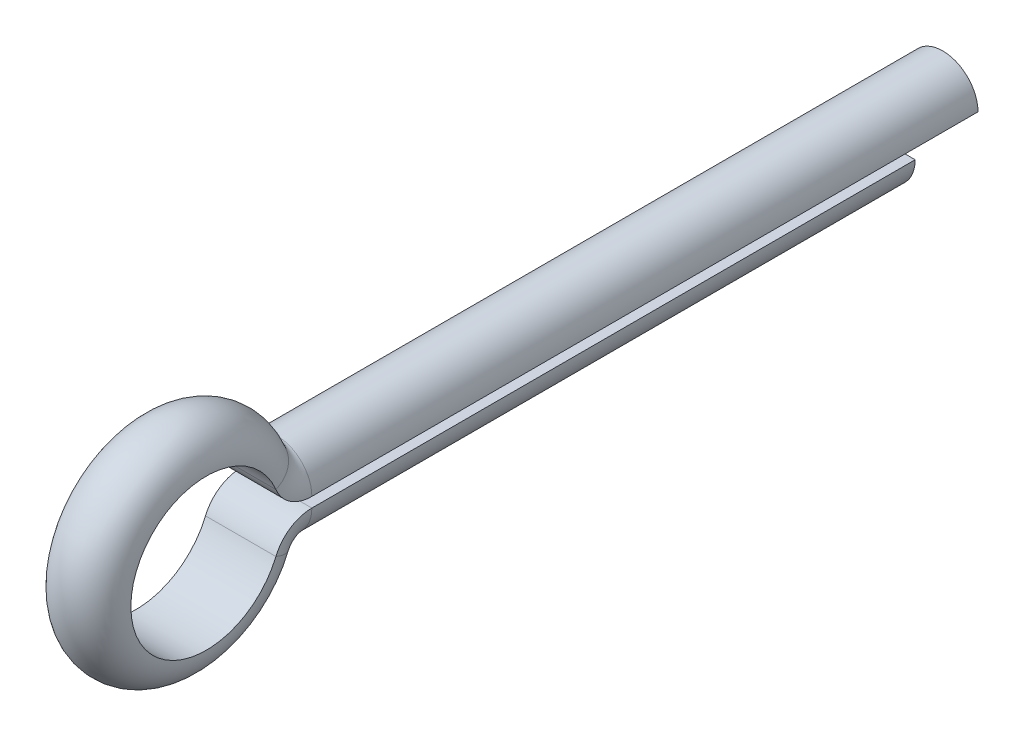
ISO-10303-21;
HEADER;
FILE_DESCRIPTION(('STEP AP214'),'2;1');
FILE_NAME('part.step','',(''),(''),'','','');
FILE_SCHEMA(('AUTOMOTIVE_DESIGN { 1 0 10303 214 1 1 1 1 }'));
ENDSEC;
DATA;
#1=APPLICATION_CONTEXT('core data for automotive mechanical design processes');
#2=APPLICATION_PROTOCOL_DEFINITION('international standard','automotive_design',2000,#1);
#3=PRODUCT_CONTEXT('',#1,'mechanical');
#4=PRODUCT('Part','Part','',(#3));
#5=PRODUCT_RELATED_PRODUCT_CATEGORY('part','',(#4));
#6=PRODUCT_DEFINITION_FORMATION('','',#4);
#7=PRODUCT_DEFINITION_CONTEXT('part definition',#1,'design');
#8=PRODUCT_DEFINITION('design','',#6,#7);
#9=PRODUCT_DEFINITION_SHAPE('','',#8);
#10=(LENGTH_UNIT() NAMED_UNIT(*) SI_UNIT(.MILLI.,.METRE.));
#11=(NAMED_UNIT(*) PLANE_ANGLE_UNIT() SI_UNIT($,.RADIAN.));
#12=(NAMED_UNIT(*) SI_UNIT($,.STERADIAN.) SOLID_ANGLE_UNIT());
#13=UNCERTAINTY_MEASURE_WITH_UNIT(LENGTH_MEASURE(1.E-05),#10,'distance_accuracy_value','');
#14=(GEOMETRIC_REPRESENTATION_CONTEXT(3) GLOBAL_UNCERTAINTY_ASSIGNED_CONTEXT((#13)) GLOBAL_UNIT_ASSIGNED_CONTEXT((#10,
#11,#12)) REPRESENTATION_CONTEXT('',''));
#15=CARTESIAN_POINT('',(0.,0.,0.));
#16=DIRECTION('',(0.,0.,1.));
#17=DIRECTION('',(1.,0.,0.));
#18=AXIS2_PLACEMENT_3D('',#15,#16,#17);
#19=CARTESIAN_POINT('',(0.,-0.1,0.));
#20=DIRECTION('',(0.,0.,1.));
#21=DIRECTION('',(1.,0.,0.));
#22=AXIS2_PLACEMENT_3D('',#19,#20,#21);
#23=PLANE('',#22);
#24=CARTESIAN_POINT('',(0.,-0.1,0.));
#25=DIRECTION('',(0.,0.,1.));
#26=DIRECTION('',(1.,0.,0.));
#27=AXIS2_PLACEMENT_3D('',#24,#25,#26);
#28=CIRCLE('',#27,0.7);
#29=CARTESIAN_POINT('',(-0.7,-0.1,0.));
#30=VERTEX_POINT('',#29);
#31=CARTESIAN_POINT('',(0.7,-0.1,0.));
#32=VERTEX_POINT('',#31);
#33=EDGE_CURVE('E47',#30,#32,#28,.T.);
#34=ORIENTED_EDGE('',*,*,#33,.F.);
#35=DIRECTION('',(-1.,0.,0.));
#36=VECTOR('',#35,1.);
#37=CARTESIAN_POINT('',(-0.7,-0.1,0.));
#38=LINE('',#37,#36);
#39=EDGE_CURVE('E11',#32,#30,#38,.T.);
#40=ORIENTED_EDGE('',*,*,#39,.F.);
#41=EDGE_LOOP('',(#34,#40));
#42=FACE_BOUND('',#41,.T.);
#43=ADVANCED_FACE('F33',(#42),#23,.F.);
#44=CARTESIAN_POINT('',(0.,0.,14.1));
#45=DIRECTION('',(1.,0.,0.));
#46=DIRECTION('',(0.,0.,-1.));
#47=AXIS2_PLACEMENT_3D('',#44,#45,#46);
#48=TOROIDAL_SURFACE('',#47,1.5,0.7);
#49=CARTESIAN_POINT('',(0.7,0.,14.1));
#50=DIRECTION('',(1.,0.,0.));
#51=DIRECTION('',(0.,0.,1.));
#52=AXIS2_PLACEMENT_3D('',#49,#50,#51);
#53=CIRCLE('',#52,1.5);
#54=CARTESIAN_POINT('',(0.7,0.576923076923077,12.7153846153846));
#55=VERTEX_POINT('',#54);
#56=CARTESIAN_POINT('',(0.7,-0.576923076923077,12.7153846153846));
#57=VERTEX_POINT('',#56);
#58=EDGE_CURVE('E123',#55,#57,#53,.T.);
#59=ORIENTED_EDGE('',*,*,#58,.F.);
#60=CARTESIAN_POINT('',(0.,0.576923076923078,12.7153846153846));
#61=DIRECTION('',(0.,-0.923076923076923,-0.384615384615384));
#62=DIRECTION('',(1.,0.,0.));
#63=AXIS2_PLACEMENT_3D('',#60,#61,#62);
#64=CIRCLE('',#63,0.7);
#65=CARTESIAN_POINT('',(-0.7,0.576923076923077,12.7153846153846));
#66=VERTEX_POINT('',#65);
#67=EDGE_CURVE('E101',#55,#66,#64,.F.);
#68=ORIENTED_EDGE('',*,*,#67,.T.);
#69=CARTESIAN_POINT('',(-0.7,0.,14.1));
#70=DIRECTION('',(1.,0.,0.));
#71=DIRECTION('',(0.,0.,1.));
#72=AXIS2_PLACEMENT_3D('',#69,#70,#71);
#73=CIRCLE('',#72,1.5);
#74=CARTESIAN_POINT('',(-0.7,-0.576923076923077,12.7153846153846));
#75=VERTEX_POINT('',#74);
#76=EDGE_CURVE('E115',#66,#75,#73,.T.);
#77=ORIENTED_EDGE('',*,*,#76,.T.);
#78=CARTESIAN_POINT('',(0.,-0.576923076923078,12.7153846153846));
#79=DIRECTION('',(0.,-0.923076923076923,0.384615384615384));
#80=DIRECTION('',(1.,0.,0.));
#81=AXIS2_PLACEMENT_3D('',#78,#79,#80);
#82=CIRCLE('',#81,0.7);
#83=EDGE_CURVE('E120',#75,#57,#82,.T.);
#84=ORIENTED_EDGE('',*,*,#83,.T.);
#85=EDGE_LOOP('',(#59,#68,#77,#84));
#86=FACE_BOUND('',#85,.T.);
#87=ADVANCED_FACE('F155',(#86),#48,.T.);
#88=CARTESIAN_POINT('',(0.,0.,14.1));
#89=DIRECTION('',(1.,0.,0.));
#90=DIRECTION('',(0.,0.,-1.));
#91=AXIS2_PLACEMENT_3D('',#88,#89,#90);
#92=CYLINDRICAL_SURFACE('',#91,1.5);
#93=DIRECTION('',(-1.,0.,0.));
#94=VECTOR('',#93,1.);
#95=CARTESIAN_POINT('',(-0.7,-0.576923076923078,12.7153846153846));
#96=LINE('',#95,#94);
#97=EDGE_CURVE('E126',#57,#75,#96,.T.);
#98=ORIENTED_EDGE('',*,*,#97,.T.);
#99=ORIENTED_EDGE('',*,*,#76,.F.);
#100=DIRECTION('',(-1.,0.,0.));
#101=VECTOR('',#100,1.);
#102=CARTESIAN_POINT('',(-0.7,0.576923076923078,12.7153846153846));
#103=LINE('',#102,#101);
#104=EDGE_CURVE('E108',#66,#55,#103,.F.);
#105=ORIENTED_EDGE('',*,*,#104,.T.);
#106=ORIENTED_EDGE('',*,*,#58,.T.);
#107=EDGE_LOOP('',(#98,#99,#105,#106));
#108=FACE_BOUND('',#107,.T.);
#109=ADVANCED_FACE('F159',(#108),#92,.F.);
#110=CARTESIAN_POINT('',(0.,-0.875,12.));
#111=DIRECTION('',(-1.,0.,0.));
#112=DIRECTION('',(0.,0.,1.));
#113=AXIS2_PLACEMENT_3D('',#110,#111,#112);
#114=TOROIDAL_SURFACE('',#113,0.775,0.7);
#115=CARTESIAN_POINT('',(0.7,-0.875,12.));
#116=DIRECTION('',(-1.,0.,0.));
#117=DIRECTION('',(0.,0.384615384615383,0.923076923076924));
#118=AXIS2_PLACEMENT_3D('',#115,#116,#117);
#119=CIRCLE('',#118,0.775);
#120=CARTESIAN_POINT('',(0.7,-0.1,12.));
#121=VERTEX_POINT('',#120);
#122=EDGE_CURVE('E132',#57,#121,#119,.T.);
#123=ORIENTED_EDGE('',*,*,#122,.F.);
#124=ORIENTED_EDGE('',*,*,#83,.F.);
#125=CARTESIAN_POINT('',(-0.7,-0.875,12.));
#126=DIRECTION('',(-1.,0.,0.));
#127=DIRECTION('',(0.,0.384615384615383,0.923076923076924));
#128=AXIS2_PLACEMENT_3D('',#125,#126,#127);
#129=CIRCLE('',#128,0.775);
#130=CARTESIAN_POINT('',(-0.7,-0.1,12.));
#131=VERTEX_POINT('',#130);
#132=EDGE_CURVE('E133',#75,#131,#129,.T.);
#133=ORIENTED_EDGE('',*,*,#132,.T.);
#134=CARTESIAN_POINT('',(0.,-0.100000000000001,12.));
#135=DIRECTION('',(0.,0.,1.));
#136=DIRECTION('',(1.,0.,0.));
#137=AXIS2_PLACEMENT_3D('',#134,#135,#136);
#138=CIRCLE('',#137,0.7);
#139=EDGE_CURVE('E129',#131,#121,#138,.T.);
#140=ORIENTED_EDGE('',*,*,#139,.T.);
#141=EDGE_LOOP('',(#123,#124,#133,#140));
#142=FACE_BOUND('',#141,.T.);
#143=ADVANCED_FACE('F153',(#142),#114,.T.);
#144=CARTESIAN_POINT('',(0.,-0.875,12.));
#145=DIRECTION('',(-1.,0.,0.));
#146=DIRECTION('',(0.,0.,1.));
#147=AXIS2_PLACEMENT_3D('',#144,#145,#146);
#148=CYLINDRICAL_SURFACE('',#147,0.775);
#149=DIRECTION('',(-1.,0.,0.));
#150=VECTOR('',#149,1.);
#151=CARTESIAN_POINT('',(-0.7,-0.100000000000001,12.));
#152=LINE('',#151,#150);
#153=EDGE_CURVE('E136',#121,#131,#152,.T.);
#154=ORIENTED_EDGE('',*,*,#153,.T.);
#155=ORIENTED_EDGE('',*,*,#132,.F.);
#156=ORIENTED_EDGE('',*,*,#97,.F.);
#157=ORIENTED_EDGE('',*,*,#122,.T.);
#158=EDGE_LOOP('',(#154,#155,#156,#157));
#159=FACE_BOUND('',#158,.T.);
#160=ADVANCED_FACE('F148',(#159),#148,.T.);
#161=CARTESIAN_POINT('',(0.,-0.100000000000002,12.));
#162=DIRECTION('',(0.,0.,-1.));
#163=DIRECTION('',(0.,1.,0.));
#164=AXIS2_PLACEMENT_3D('',#161,#162,#163);
#165=CYLINDRICAL_SURFACE('',#164,0.7);
#166=DIRECTION('',(0.,0.,-1.));
#167=VECTOR('',#166,1.);
#168=CARTESIAN_POINT('',(0.7,-0.100000000000001,12.));
#169=LINE('',#168,#167);
#170=EDGE_CURVE('E40',#121,#32,#169,.T.);
#171=ORIENTED_EDGE('',*,*,#170,.F.);
#172=ORIENTED_EDGE('',*,*,#139,.F.);
#173=DIRECTION('',(0.,0.,-1.));
#174=VECTOR('',#173,1.);
#175=CARTESIAN_POINT('',(-0.7,-0.100000000000001,12.));
#176=LINE('',#175,#174);
#177=EDGE_CURVE('E140',#131,#30,#176,.T.);
#178=ORIENTED_EDGE('',*,*,#177,.T.);
#179=ORIENTED_EDGE('',*,*,#33,.T.);
#180=EDGE_LOOP('',(#171,#172,#178,#179));
#181=FACE_BOUND('',#180,.T.);
#182=ADVANCED_FACE('F150',(#181),#165,.T.);
#183=CARTESIAN_POINT('',(-0.7,-0.100000000000001,12.));
#184=DIRECTION('',(0.,-1.,0.));
#185=DIRECTION('',(0.,0.,-1.));
#186=AXIS2_PLACEMENT_3D('',#183,#184,#185);
#187=PLANE('',#186);
#188=ORIENTED_EDGE('',*,*,#39,.T.);
#189=ORIENTED_EDGE('',*,*,#177,.F.);
#190=ORIENTED_EDGE('',*,*,#153,.F.);
#191=ORIENTED_EDGE('',*,*,#170,.T.);
#192=EDGE_LOOP('',(#188,#189,#190,#191));
#193=FACE_BOUND('',#192,.T.);
#194=ADVANCED_FACE('F173',(#193),#187,.F.);
#195=CARTESIAN_POINT('',(0.,0.875,12.));
#196=DIRECTION('',(1.,0.,0.));
#197=DIRECTION('',(0.,0.,-1.));
#198=AXIS2_PLACEMENT_3D('',#195,#196,#197);
#199=TOROIDAL_SURFACE('',#198,0.775,0.7);
#200=CARTESIAN_POINT('',(-0.7,0.875,12.));
#201=DIRECTION('',(1.,0.,0.));
#202=DIRECTION('',(0.,-0.384615384615383,0.923076923076924));
#203=AXIS2_PLACEMENT_3D('',#200,#201,#202);
#204=CIRCLE('',#203,0.775);
#205=CARTESIAN_POINT('',(-0.7,0.1,12.));
#206=VERTEX_POINT('',#205);
#207=EDGE_CURVE('E110',#66,#206,#204,.T.);
#208=ORIENTED_EDGE('',*,*,#207,.F.);
#209=ORIENTED_EDGE('',*,*,#67,.F.);
#210=CARTESIAN_POINT('',(0.7,0.875,12.));
#211=DIRECTION('',(1.,0.,0.));
#212=DIRECTION('',(0.,-0.384615384615383,0.923076923076924));
#213=AXIS2_PLACEMENT_3D('',#210,#211,#212);
#214=CIRCLE('',#213,0.775);
#215=CARTESIAN_POINT('',(0.7,0.1,12.));
#216=VERTEX_POINT('',#215);
#217=EDGE_CURVE('E111',#55,#216,#214,.T.);
#218=ORIENTED_EDGE('',*,*,#217,.T.);
#219=CARTESIAN_POINT('',(0.,0.100000000000001,12.));
#220=DIRECTION('',(0.,0.,-1.));
#221=DIRECTION('',(1.,0.,0.));
#222=AXIS2_PLACEMENT_3D('',#219,#220,#221);
#223=CIRCLE('',#222,0.7);
#224=EDGE_CURVE('E89',#216,#206,#223,.F.);
#225=ORIENTED_EDGE('',*,*,#224,.T.);
#226=EDGE_LOOP('',(#208,#209,#218,#225));
#227=FACE_BOUND('',#226,.T.);
#228=ADVANCED_FACE('F162',(#227),#199,.T.);
#229=CARTESIAN_POINT('',(0.,0.875,12.));
#230=DIRECTION('',(1.,0.,0.));
#231=DIRECTION('',(0.,0.,-1.));
#232=AXIS2_PLACEMENT_3D('',#229,#230,#231);
#233=CYLINDRICAL_SURFACE('',#232,0.775);
#234=DIRECTION('',(-1.,0.,0.));
#235=VECTOR('',#234,1.);
#236=CARTESIAN_POINT('',(-0.7,0.100000000000001,12.));
#237=LINE('',#236,#235);
#238=EDGE_CURVE('E95',#206,#216,#237,.F.);
#239=ORIENTED_EDGE('',*,*,#238,.T.);
#240=ORIENTED_EDGE('',*,*,#217,.F.);
#241=ORIENTED_EDGE('',*,*,#104,.F.);
#242=ORIENTED_EDGE('',*,*,#207,.T.);
#243=EDGE_LOOP('',(#239,#240,#241,#242));
#244=FACE_BOUND('',#243,.T.);
#245=ADVANCED_FACE('F165',(#244),#233,.T.);
#246=CARTESIAN_POINT('',(0.,0.100000000000002,12.));
#247=DIRECTION('',(0.,0.,-1.));
#248=DIRECTION('',(0.,1.,0.));
#249=AXIS2_PLACEMENT_3D('',#246,#247,#248);
#250=CYLINDRICAL_SURFACE('',#249,0.7);
#251=DIRECTION('',(0.,0.,-1.));
#252=VECTOR('',#251,1.);
#253=CARTESIAN_POINT('',(-0.7,0.100000000000001,12.));
#254=LINE('',#253,#252);
#255=CARTESIAN_POINT('',(-0.7,0.1,-1.25));
#256=VERTEX_POINT('',#255);
#257=EDGE_CURVE('E94',#206,#256,#254,.T.);
#258=ORIENTED_EDGE('',*,*,#257,.F.);
#259=ORIENTED_EDGE('',*,*,#224,.F.);
#260=DIRECTION('',(0.,0.,-1.));
#261=VECTOR('',#260,1.);
#262=CARTESIAN_POINT('',(0.7,0.100000000000001,12.));
#263=LINE('',#262,#261);
#264=CARTESIAN_POINT('',(0.7,0.1,-1.25));
#265=VERTEX_POINT('',#264);
#266=EDGE_CURVE('E83',#216,#265,#263,.T.);
#267=ORIENTED_EDGE('',*,*,#266,.T.);
#268=CARTESIAN_POINT('',(0.,0.1,-1.25));
#269=DIRECTION('',(0.,0.,-1.));
#270=DIRECTION('',(-1.,0.,0.));
#271=AXIS2_PLACEMENT_3D('',#268,#269,#270);
#272=CIRCLE('',#271,0.7);
#273=EDGE_CURVE('E87',#256,#265,#272,.T.);
#274=ORIENTED_EDGE('',*,*,#273,.F.);
#275=EDGE_LOOP('',(#258,#259,#267,#274));
#276=FACE_BOUND('',#275,.T.);
#277=ADVANCED_FACE('F85',(#276),#250,.T.);
#278=CARTESIAN_POINT('',(-0.7,0.100000000000001,12.));
#279=DIRECTION('',(0.,1.,0.));
#280=DIRECTION('',(0.,0.,1.));
#281=AXIS2_PLACEMENT_3D('',#278,#279,#280);
#282=PLANE('',#281);
#283=ORIENTED_EDGE('',*,*,#257,.T.);
#284=DIRECTION('',(-1.,0.,0.));
#285=VECTOR('',#284,1.);
#286=CARTESIAN_POINT('',(-0.7,0.1,-1.25));
#287=LINE('',#286,#285);
#288=EDGE_CURVE('E98',#265,#256,#287,.T.);
#289=ORIENTED_EDGE('',*,*,#288,.F.);
#290=ORIENTED_EDGE('',*,*,#266,.F.);
#291=ORIENTED_EDGE('',*,*,#238,.F.);
#292=EDGE_LOOP('',(#283,#289,#290,#291));
#293=FACE_BOUND('',#292,.T.);
#294=ADVANCED_FACE('F99',(#293),#282,.F.);
#295=CARTESIAN_POINT('',(0.,0.1,-1.25));
#296=DIRECTION('',(0.,0.,-1.));
#297=DIRECTION('',(-1.,0.,0.));
#298=AXIS2_PLACEMENT_3D('',#295,#296,#297);
#299=PLANE('',#298);
#300=ORIENTED_EDGE('',*,*,#273,.T.);
#301=ORIENTED_EDGE('',*,*,#288,.T.);
#302=EDGE_LOOP('',(#300,#301));
#303=FACE_BOUND('',#302,.T.);
#304=ADVANCED_FACE('F103',(#303),#299,.T.);
#305=CLOSED_SHELL('',(#43,#87,#109,#143,#160,#182,#194,#228,#245,#277,#294,#304));
#306=MANIFOLD_SOLID_BREP('B2',#305);
#307=ADVANCED_BREP_SHAPE_REPRESENTATION('',(#18,#306),#14);
#308=SHAPE_DEFINITION_REPRESENTATION(#9,#307);
ENDSEC;
END-ISO-10303-21;
